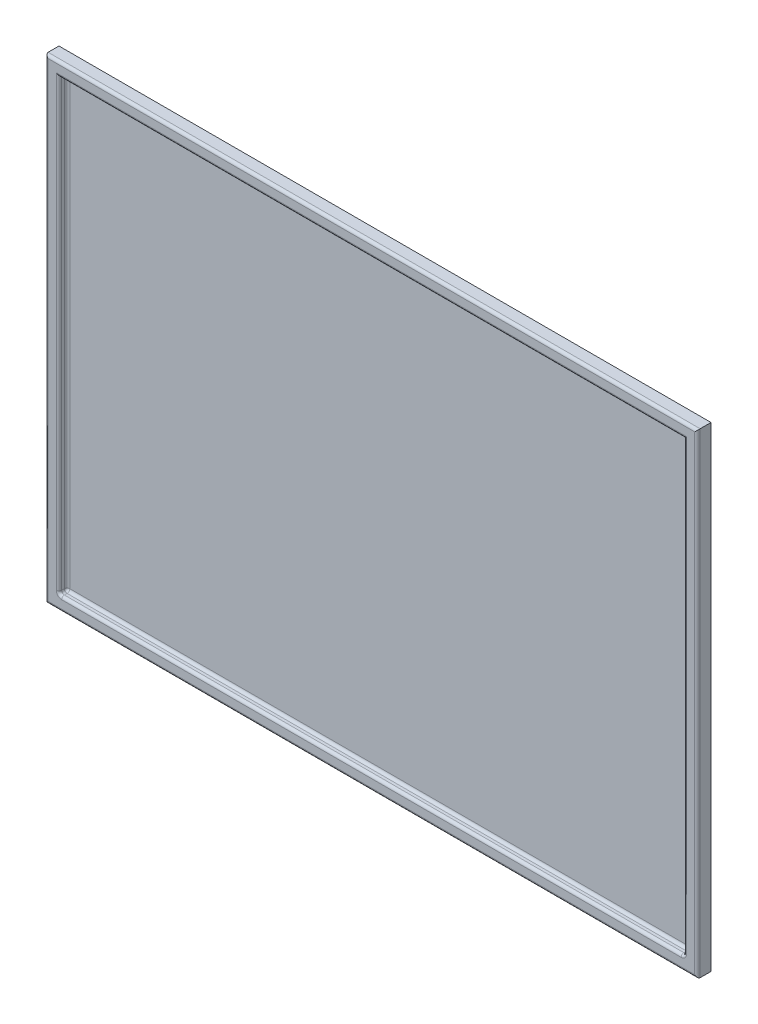
ISO-10303-21;
HEADER;
FILE_DESCRIPTION(('STEP AP214'),'2;1');
FILE_NAME('part.step','',(''),(''),'','','');
FILE_SCHEMA(('AUTOMOTIVE_DESIGN { 1 0 10303 214 1 1 1 1 }'));
ENDSEC;
DATA;
#1=APPLICATION_CONTEXT('core data for automotive mechanical design processes');
#2=APPLICATION_PROTOCOL_DEFINITION('international standard','automotive_design',2000,#1);
#3=PRODUCT_CONTEXT('',#1,'mechanical');
#4=PRODUCT('Part','Part','',(#3));
#5=PRODUCT_RELATED_PRODUCT_CATEGORY('part','',(#4));
#6=PRODUCT_DEFINITION_FORMATION('','',#4);
#7=PRODUCT_DEFINITION_CONTEXT('part definition',#1,'design');
#8=PRODUCT_DEFINITION('design','',#6,#7);
#9=PRODUCT_DEFINITION_SHAPE('','',#8);
#10=(LENGTH_UNIT() NAMED_UNIT(*) SI_UNIT(.MILLI.,.METRE.));
#11=(NAMED_UNIT(*) PLANE_ANGLE_UNIT() SI_UNIT($,.RADIAN.));
#12=(NAMED_UNIT(*) SI_UNIT($,.STERADIAN.) SOLID_ANGLE_UNIT());
#13=UNCERTAINTY_MEASURE_WITH_UNIT(LENGTH_MEASURE(1.E-05),#10,'distance_accuracy_value','');
#14=(GEOMETRIC_REPRESENTATION_CONTEXT(3) GLOBAL_UNCERTAINTY_ASSIGNED_CONTEXT((#13)) GLOBAL_UNIT_ASSIGNED_CONTEXT((#10,
#11,#12)) REPRESENTATION_CONTEXT('',''));
#15=CARTESIAN_POINT('',(0.,0.,0.));
#16=DIRECTION('',(0.,0.,1.));
#17=DIRECTION('',(1.,0.,0.));
#18=AXIS2_PLACEMENT_3D('',#15,#16,#17);
#19=CARTESIAN_POINT('',(-115.182250396197,67.8129952456418,5.));
#20=DIRECTION('',(1.,0.,0.));
#21=DIRECTION('',(0.,1.,0.));
#22=AXIS2_PLACEMENT_3D('',#19,#20,#21);
#23=PLANE('',#22);
#24=DIRECTION('',(0.,0.,-1.));
#25=VECTOR('',#24,1.);
#26=CARTESIAN_POINT('',(-115.182250396196,-107.187004754358,5.));
#27=LINE('',#26,#25);
#28=CARTESIAN_POINT('',(-115.182250396196,-107.187004754358,4.));
#29=VERTEX_POINT('',#28);
#30=CARTESIAN_POINT('',(-115.182250396196,-107.187004754358,0.));
#31=VERTEX_POINT('',#30);
#32=EDGE_CURVE('E161',#29,#31,#27,.T.);
#33=ORIENTED_EDGE('',*,*,#32,.F.);
#34=DIRECTION('',(0.,-1.,0.));
#35=VECTOR('',#34,1.);
#36=CARTESIAN_POINT('',(-115.182250396197,67.8129952456418,4.));
#37=LINE('',#36,#35);
#38=CARTESIAN_POINT('',(-115.182250396197,67.8129952456418,4.));
#39=VERTEX_POINT('',#38);
#40=EDGE_CURVE('E275',#29,#39,#37,.F.);
#41=ORIENTED_EDGE('',*,*,#40,.T.);
#42=DIRECTION('',(0.,0.,-1.));
#43=VECTOR('',#42,1.);
#44=CARTESIAN_POINT('',(-115.182250396197,67.8129952456418,5.));
#45=LINE('',#44,#43);
#46=CARTESIAN_POINT('',(-115.182250396197,67.8129952456418,0.));
#47=VERTEX_POINT('',#46);
#48=EDGE_CURVE('E183',#39,#47,#45,.T.);
#49=ORIENTED_EDGE('',*,*,#48,.T.);
#50=DIRECTION('',(0.,-1.,0.));
#51=VECTOR('',#50,1.);
#52=CARTESIAN_POINT('',(-115.182250396197,67.8129952456418,0.));
#53=LINE('',#52,#51);
#54=EDGE_CURVE('E178',#47,#31,#53,.T.);
#55=ORIENTED_EDGE('',*,*,#54,.T.);
#56=EDGE_LOOP('',(#33,#41,#49,#55));
#57=FACE_BOUND('',#56,.T.);
#58=ADVANCED_FACE('F41',(#57),#23,.F.);
#59=CARTESIAN_POINT('',(-115.182250396196,-107.187004754358,5.));
#60=DIRECTION('',(0.,1.,0.));
#61=DIRECTION('',(-1.,0.,0.));
#62=AXIS2_PLACEMENT_3D('',#59,#60,#61);
#63=PLANE('',#62);
#64=DIRECTION('',(0.,0.,-1.));
#65=VECTOR('',#64,1.);
#66=CARTESIAN_POINT('',(124.817749603803,-107.187004754358,5.));
#67=LINE('',#66,#65);
#68=CARTESIAN_POINT('',(124.817749603803,-107.187004754358,4.));
#69=VERTEX_POINT('',#68);
#70=CARTESIAN_POINT('',(124.817749603803,-107.187004754358,0.));
#71=VERTEX_POINT('',#70);
#72=EDGE_CURVE('E172',#69,#71,#67,.T.);
#73=ORIENTED_EDGE('',*,*,#72,.F.);
#74=DIRECTION('',(1.,0.,0.));
#75=VECTOR('',#74,1.);
#76=CARTESIAN_POINT('',(-115.182250396196,-107.187004754358,4.));
#77=LINE('',#76,#75);
#78=EDGE_CURVE('E168',#69,#29,#77,.F.);
#79=ORIENTED_EDGE('',*,*,#78,.T.);
#80=ORIENTED_EDGE('',*,*,#32,.T.);
#81=DIRECTION('',(1.,0.,0.));
#82=VECTOR('',#81,1.);
#83=CARTESIAN_POINT('',(-115.182250396196,-107.187004754358,0.));
#84=LINE('',#83,#82);
#85=EDGE_CURVE('E165',#31,#71,#84,.T.);
#86=ORIENTED_EDGE('',*,*,#85,.T.);
#87=EDGE_LOOP('',(#73,#79,#80,#86));
#88=FACE_BOUND('',#87,.T.);
#89=ADVANCED_FACE('F164',(#88),#63,.F.);
#90=CARTESIAN_POINT('',(124.817749603803,67.8129952456418,5.));
#91=DIRECTION('',(-1.,0.,0.));
#92=DIRECTION('',(0.,0.,1.));
#93=AXIS2_PLACEMENT_3D('',#90,#91,#92);
#94=PLANE('',#93);
#95=DIRECTION('',(0.,0.,-1.));
#96=VECTOR('',#95,1.);
#97=CARTESIAN_POINT('',(124.817749603803,67.8129952456418,5.));
#98=LINE('',#97,#96);
#99=CARTESIAN_POINT('',(124.817749603803,67.8129952456418,4.));
#100=VERTEX_POINT('',#99);
#101=CARTESIAN_POINT('',(124.817749603803,67.8129952456418,0.));
#102=VERTEX_POINT('',#101);
#103=EDGE_CURVE('E195',#100,#102,#98,.T.);
#104=ORIENTED_EDGE('',*,*,#103,.F.);
#105=DIRECTION('',(0.,1.,0.));
#106=VECTOR('',#105,1.);
#107=CARTESIAN_POINT('',(124.817749603803,-107.187004754358,4.));
#108=LINE('',#107,#106);
#109=EDGE_CURVE('E271',#100,#69,#108,.F.);
#110=ORIENTED_EDGE('',*,*,#109,.T.);
#111=ORIENTED_EDGE('',*,*,#72,.T.);
#112=DIRECTION('',(0.,1.,0.));
#113=VECTOR('',#112,1.);
#114=CARTESIAN_POINT('',(124.817749603803,67.8129952456418,0.));
#115=LINE('',#114,#113);
#116=EDGE_CURVE('E180',#71,#102,#115,.T.);
#117=ORIENTED_EDGE('',*,*,#116,.T.);
#118=EDGE_LOOP('',(#104,#110,#111,#117));
#119=FACE_BOUND('',#118,.T.);
#120=ADVANCED_FACE('F373',(#119),#94,.F.);
#121=CARTESIAN_POINT('',(-115.182250396197,67.8129952456418,5.));
#122=DIRECTION('',(0.,-1.,0.));
#123=DIRECTION('',(0.,0.,-1.));
#124=AXIS2_PLACEMENT_3D('',#121,#122,#123);
#125=PLANE('',#124);
#126=ORIENTED_EDGE('',*,*,#48,.F.);
#127=DIRECTION('',(-1.,0.,0.));
#128=VECTOR('',#127,1.);
#129=CARTESIAN_POINT('',(124.817749603803,67.8129952456418,4.));
#130=LINE('',#129,#128);
#131=EDGE_CURVE('E273',#39,#100,#130,.F.);
#132=ORIENTED_EDGE('',*,*,#131,.T.);
#133=ORIENTED_EDGE('',*,*,#103,.T.);
#134=DIRECTION('',(-1.,0.,0.));
#135=VECTOR('',#134,1.);
#136=CARTESIAN_POINT('',(-115.182250396197,67.8129952456418,0.));
#137=LINE('',#136,#135);
#138=EDGE_CURVE('E192',#102,#47,#137,.T.);
#139=ORIENTED_EDGE('',*,*,#138,.T.);
#140=EDGE_LOOP('',(#126,#132,#133,#139));
#141=FACE_BOUND('',#140,.T.);
#142=ADVANCED_FACE('F547',(#141),#125,.F.);
#143=CARTESIAN_POINT('',(0.,0.,5.));
#144=DIRECTION('',(0.,0.,1.));
#145=DIRECTION('',(1.,0.,0.));
#146=AXIS2_PLACEMENT_3D('',#143,#144,#145);
#147=PLANE('',#146);
#148=DIRECTION('',(0.,-1.,0.));
#149=VECTOR('',#148,1.);
#150=CARTESIAN_POINT('',(-114.182250396196,-107.187004754358,5.));
#151=LINE('',#150,#149);
#152=CARTESIAN_POINT('',(-114.182250396197,66.8129952456418,5.));
#153=VERTEX_POINT('',#152);
#154=CARTESIAN_POINT('',(-114.182250396196,-106.187004754358,5.));
#155=VERTEX_POINT('',#154);
#156=EDGE_CURVE('E237',#153,#155,#151,.T.);
#157=ORIENTED_EDGE('',*,*,#156,.T.);
#158=DIRECTION('',(1.,0.,0.));
#159=VECTOR('',#158,1.);
#160=CARTESIAN_POINT('',(124.817749603803,-106.187004754358,5.));
#161=LINE('',#160,#159);
#162=CARTESIAN_POINT('',(123.817749603803,-106.187004754358,5.));
#163=VERTEX_POINT('',#162);
#164=EDGE_CURVE('E267',#155,#163,#161,.T.);
#165=ORIENTED_EDGE('',*,*,#164,.T.);
#166=DIRECTION('',(0.,1.,0.));
#167=VECTOR('',#166,1.);
#168=CARTESIAN_POINT('',(123.817749603803,67.8129952456418,5.));
#169=LINE('',#168,#167);
#170=CARTESIAN_POINT('',(123.817749603803,66.8129952456418,5.));
#171=VERTEX_POINT('',#170);
#172=EDGE_CURVE('E265',#163,#171,#169,.T.);
#173=ORIENTED_EDGE('',*,*,#172,.T.);
#174=DIRECTION('',(-1.,0.,0.));
#175=VECTOR('',#174,1.);
#176=CARTESIAN_POINT('',(-115.182250396197,66.8129952456418,5.));
#177=LINE('',#176,#175);
#178=EDGE_CURVE('E263',#171,#153,#177,.T.);
#179=ORIENTED_EDGE('',*,*,#178,.T.);
#180=EDGE_LOOP('',(#157,#165,#173,#179));
#181=FACE_BOUND('',#180,.T.);
#182=CARTESIAN_POINT('',(118.817749603803,-101.187004754358,5.));
#183=DIRECTION('',(0.,0.,1.));
#184=DIRECTION('',(1.,0.,0.));
#185=AXIS2_PLACEMENT_3D('',#182,#183,#184);
#186=CIRCLE('',#185,2.);
#187=CARTESIAN_POINT('',(118.817749603803,-103.187004754358,5.));
#188=VERTEX_POINT('',#187);
#189=CARTESIAN_POINT('',(120.817749603803,-101.187004754358,5.));
#190=VERTEX_POINT('',#189);
#191=EDGE_CURVE('E220',#188,#190,#186,.T.);
#192=ORIENTED_EDGE('',*,*,#191,.F.);
#193=DIRECTION('',(1.,0.,0.));
#194=VECTOR('',#193,1.);
#195=CARTESIAN_POINT('',(-110.182250396196,-103.187004754358,5.));
#196=LINE('',#195,#194);
#197=CARTESIAN_POINT('',(-109.182250396196,-103.187004754358,5.));
#198=VERTEX_POINT('',#197);
#199=EDGE_CURVE('E231',#188,#198,#196,.F.);
#200=ORIENTED_EDGE('',*,*,#199,.T.);
#201=CARTESIAN_POINT('',(-109.182250396196,-101.187004754358,5.));
#202=DIRECTION('',(0.,0.,1.));
#203=DIRECTION('',(1.,0.,0.));
#204=AXIS2_PLACEMENT_3D('',#201,#202,#203);
#205=CIRCLE('',#204,2.);
#206=CARTESIAN_POINT('',(-111.182250396196,-101.187004754358,5.));
#207=VERTEX_POINT('',#206);
#208=EDGE_CURVE('E229',#207,#198,#205,.T.);
#209=ORIENTED_EDGE('',*,*,#208,.F.);
#210=DIRECTION('',(0.,-1.,0.));
#211=VECTOR('',#210,1.);
#212=CARTESIAN_POINT('',(-111.182250396197,62.8129952456418,5.));
#213=LINE('',#212,#211);
#214=CARTESIAN_POINT('',(-111.182250396197,63.8129952456418,5.));
#215=VERTEX_POINT('',#214);
#216=EDGE_CURVE('E227',#207,#215,#213,.F.);
#217=ORIENTED_EDGE('',*,*,#216,.T.);
#218=DIRECTION('',(-1.,0.,0.));
#219=VECTOR('',#218,1.);
#220=CARTESIAN_POINT('',(119.817749603803,63.8129952456418,5.));
#221=LINE('',#220,#219);
#222=CARTESIAN_POINT('',(120.817749603803,63.8129952456418,5.));
#223=VERTEX_POINT('',#222);
#224=EDGE_CURVE('E225',#215,#223,#221,.F.);
#225=ORIENTED_EDGE('',*,*,#224,.T.);
#226=DIRECTION('',(0.,1.,0.));
#227=VECTOR('',#226,1.);
#228=CARTESIAN_POINT('',(120.817749603803,-102.187004754358,5.));
#229=LINE('',#228,#227);
#230=EDGE_CURVE('E223',#223,#190,#229,.F.);
#231=ORIENTED_EDGE('',*,*,#230,.T.);
#232=EDGE_LOOP('',(#192,#200,#209,#217,#225,#231));
#233=FACE_BOUND('',#232,.T.);
#234=ADVANCED_FACE('F542',(#181,#233),#147,.T.);
#235=CARTESIAN_POINT('',(0.,0.,0.));
#236=DIRECTION('',(0.,0.,1.));
#237=DIRECTION('',(1.,0.,0.));
#238=AXIS2_PLACEMENT_3D('',#235,#236,#237);
#239=PLANE('',#238);
#240=ORIENTED_EDGE('',*,*,#54,.F.);
#241=ORIENTED_EDGE('',*,*,#138,.F.);
#242=ORIENTED_EDGE('',*,*,#116,.F.);
#243=ORIENTED_EDGE('',*,*,#85,.F.);
#244=EDGE_LOOP('',(#240,#241,#242,#243));
#245=FACE_BOUND('',#244,.T.);
#246=ADVANCED_FACE('F176',(#245),#239,.F.);
#247=CARTESIAN_POINT('',(119.817749603803,62.8129952456418,2.));
#248=DIRECTION('',(0.,1.,0.));
#249=DIRECTION('',(0.,0.,1.));
#250=AXIS2_PLACEMENT_3D('',#247,#248,#249);
#251=PLANE('',#250);
#252=DIRECTION('',(0.,0.,1.));
#253=VECTOR('',#252,1.);
#254=CARTESIAN_POINT('',(-110.182250396197,62.8129952456418,2.));
#255=LINE('',#254,#253);
#256=CARTESIAN_POINT('',(-110.182250396197,62.8129952456418,3.));
#257=VERTEX_POINT('',#256);
#258=CARTESIAN_POINT('',(-110.182250396197,62.8129952456418,4.));
#259=VERTEX_POINT('',#258);
#260=EDGE_CURVE('E187',#257,#259,#255,.T.);
#261=ORIENTED_EDGE('',*,*,#260,.F.);
#262=DIRECTION('',(-1.,0.,0.));
#263=VECTOR('',#262,1.);
#264=CARTESIAN_POINT('',(119.817749603803,62.8129952456418,3.));
#265=LINE('',#264,#263);
#266=CARTESIAN_POINT('',(119.817749603803,62.8129952456418,3.));
#267=VERTEX_POINT('',#266);
#268=EDGE_CURVE('E50',#257,#267,#265,.F.);
#269=ORIENTED_EDGE('',*,*,#268,.T.);
#270=DIRECTION('',(0.,0.,1.));
#271=VECTOR('',#270,1.);
#272=CARTESIAN_POINT('',(119.817749603803,62.8129952456418,2.));
#273=LINE('',#272,#271);
#274=CARTESIAN_POINT('',(119.817749603803,62.8129952456418,4.));
#275=VERTEX_POINT('',#274);
#276=EDGE_CURVE('E185',#267,#275,#273,.T.);
#277=ORIENTED_EDGE('',*,*,#276,.T.);
#278=DIRECTION('',(-1.,0.,0.));
#279=VECTOR('',#278,1.);
#280=CARTESIAN_POINT('',(-110.182250396197,62.8129952456418,4.));
#281=LINE('',#280,#279);
#282=EDGE_CURVE('E234',#275,#259,#281,.T.);
#283=ORIENTED_EDGE('',*,*,#282,.T.);
#284=EDGE_LOOP('',(#261,#269,#277,#283));
#285=FACE_BOUND('',#284,.T.);
#286=ADVANCED_FACE('F504',(#285),#251,.F.);
#287=CARTESIAN_POINT('',(119.817749603803,-102.187004754358,2.));
#288=DIRECTION('',(1.,0.,0.));
#289=DIRECTION('',(0.,0.,-1.));
#290=AXIS2_PLACEMENT_3D('',#287,#288,#289);
#291=PLANE('',#290);
#292=ORIENTED_EDGE('',*,*,#276,.F.);
#293=DIRECTION('',(0.,1.,0.));
#294=VECTOR('',#293,1.);
#295=CARTESIAN_POINT('',(119.817749603803,-102.187004754358,3.));
#296=LINE('',#295,#294);
#297=CARTESIAN_POINT('',(119.817749603803,-101.187004754358,3.));
#298=VERTEX_POINT('',#297);
#299=EDGE_CURVE('E301',#267,#298,#296,.F.);
#300=ORIENTED_EDGE('',*,*,#299,.T.);
#301=DIRECTION('',(0.,0.,1.));
#302=VECTOR('',#301,1.);
#303=CARTESIAN_POINT('',(119.817749603803,-101.187004754358,5.));
#304=LINE('',#303,#302);
#305=CARTESIAN_POINT('',(119.817749603803,-101.187004754358,4.));
#306=VERTEX_POINT('',#305);
#307=EDGE_CURVE('E218',#298,#306,#304,.T.);
#308=ORIENTED_EDGE('',*,*,#307,.T.);
#309=DIRECTION('',(0.,1.,0.));
#310=VECTOR('',#309,1.);
#311=CARTESIAN_POINT('',(119.817749603803,62.8129952456418,4.));
#312=LINE('',#311,#310);
#313=EDGE_CURVE('E215',#306,#275,#312,.T.);
#314=ORIENTED_EDGE('',*,*,#313,.T.);
#315=EDGE_LOOP('',(#292,#300,#308,#314));
#316=FACE_BOUND('',#315,.T.);
#317=ADVANCED_FACE('F495',(#316),#291,.F.);
#318=CARTESIAN_POINT('',(-110.182250396196,-102.187004754358,2.));
#319=DIRECTION('',(0.,-1.,0.));
#320=DIRECTION('',(1.,0.,0.));
#321=AXIS2_PLACEMENT_3D('',#318,#319,#320);
#322=PLANE('',#321);
#323=DIRECTION('',(1.,0.,0.));
#324=VECTOR('',#323,1.);
#325=CARTESIAN_POINT('',(-110.182250396196,-102.187004754358,3.));
#326=LINE('',#325,#324);
#327=CARTESIAN_POINT('',(118.817749603803,-102.187004754358,3.));
#328=VERTEX_POINT('',#327);
#329=CARTESIAN_POINT('',(-109.182250396196,-102.187004754358,3.));
#330=VERTEX_POINT('',#329);
#331=EDGE_CURVE('E202',#328,#330,#326,.F.);
#332=ORIENTED_EDGE('',*,*,#331,.T.);
#333=DIRECTION('',(0.,0.,1.));
#334=VECTOR('',#333,1.);
#335=CARTESIAN_POINT('',(-109.182250396196,-102.187004754358,5.));
#336=LINE('',#335,#334);
#337=CARTESIAN_POINT('',(-109.182250396196,-102.187004754358,4.));
#338=VERTEX_POINT('',#337);
#339=EDGE_CURVE('E205',#330,#338,#336,.T.);
#340=ORIENTED_EDGE('',*,*,#339,.T.);
#341=DIRECTION('',(1.,0.,0.));
#342=VECTOR('',#341,1.);
#343=CARTESIAN_POINT('',(119.817749603803,-102.187004754358,4.));
#344=LINE('',#343,#342);
#345=CARTESIAN_POINT('',(118.817749603803,-102.187004754358,4.));
#346=VERTEX_POINT('',#345);
#347=EDGE_CURVE('E171',#338,#346,#344,.T.);
#348=ORIENTED_EDGE('',*,*,#347,.T.);
#349=DIRECTION('',(0.,0.,1.));
#350=VECTOR('',#349,1.);
#351=CARTESIAN_POINT('',(118.817749603803,-102.187004754358,2.));
#352=LINE('',#351,#350);
#353=EDGE_CURVE('E199',#346,#328,#352,.F.);
#354=ORIENTED_EDGE('',*,*,#353,.T.);
#355=EDGE_LOOP('',(#332,#340,#348,#354));
#356=FACE_BOUND('',#355,.T.);
#357=ADVANCED_FACE('F328',(#356),#322,.F.);
#358=CARTESIAN_POINT('',(-110.182250396197,62.8129952456418,2.));
#359=DIRECTION('',(-1.,0.,0.));
#360=DIRECTION('',(0.,-1.,0.));
#361=AXIS2_PLACEMENT_3D('',#358,#359,#360);
#362=PLANE('',#361);
#363=DIRECTION('',(0.,0.,1.));
#364=VECTOR('',#363,1.);
#365=CARTESIAN_POINT('',(-110.182250396196,-101.187004754358,2.));
#366=LINE('',#365,#364);
#367=CARTESIAN_POINT('',(-110.182250396196,-101.187004754358,4.));
#368=VERTEX_POINT('',#367);
#369=CARTESIAN_POINT('',(-110.182250396196,-101.187004754358,3.));
#370=VERTEX_POINT('',#369);
#371=EDGE_CURVE('E210',#368,#370,#366,.F.);
#372=ORIENTED_EDGE('',*,*,#371,.T.);
#373=DIRECTION('',(0.,-1.,0.));
#374=VECTOR('',#373,1.);
#375=CARTESIAN_POINT('',(-110.182250396197,62.8129952456418,3.));
#376=LINE('',#375,#374);
#377=EDGE_CURVE('E11',#370,#257,#376,.F.);
#378=ORIENTED_EDGE('',*,*,#377,.T.);
#379=ORIENTED_EDGE('',*,*,#260,.T.);
#380=DIRECTION('',(0.,-1.,0.));
#381=VECTOR('',#380,1.);
#382=CARTESIAN_POINT('',(-110.182250396196,-102.187004754358,4.));
#383=LINE('',#382,#381);
#384=EDGE_CURVE('E208',#259,#368,#383,.T.);
#385=ORIENTED_EDGE('',*,*,#384,.T.);
#386=EDGE_LOOP('',(#372,#378,#379,#385));
#387=FACE_BOUND('',#386,.T.);
#388=ADVANCED_FACE('F476',(#387),#362,.F.);
#389=CARTESIAN_POINT('',(0.,0.,2.));
#390=DIRECTION('',(0.,0.,1.));
#391=DIRECTION('',(1.,0.,0.));
#392=AXIS2_PLACEMENT_3D('',#389,#390,#391);
#393=PLANE('',#392);
#394=DIRECTION('',(1.,0.,0.));
#395=VECTOR('',#394,1.);
#396=CARTESIAN_POINT('',(0.,-101.187004754358,2.));
#397=LINE('',#396,#395);
#398=CARTESIAN_POINT('',(-109.182250396196,-101.187004754358,2.));
#399=VERTEX_POINT('',#398);
#400=CARTESIAN_POINT('',(118.817749603803,-101.187004754358,2.));
#401=VERTEX_POINT('',#400);
#402=EDGE_CURVE('E212',#399,#401,#397,.T.);
#403=ORIENTED_EDGE('',*,*,#402,.T.);
#404=DIRECTION('',(0.,1.,0.));
#405=VECTOR('',#404,1.);
#406=CARTESIAN_POINT('',(118.817749603803,0.,2.));
#407=LINE('',#406,#405);
#408=CARTESIAN_POINT('',(118.817749603803,61.8129952456418,2.));
#409=VERTEX_POINT('',#408);
#410=EDGE_CURVE('E299',#401,#409,#407,.T.);
#411=ORIENTED_EDGE('',*,*,#410,.T.);
#412=DIRECTION('',(-1.,0.,0.));
#413=VECTOR('',#412,1.);
#414=CARTESIAN_POINT('',(0.,61.8129952456418,2.));
#415=LINE('',#414,#413);
#416=CARTESIAN_POINT('',(-109.182250396196,61.8129952456418,2.));
#417=VERTEX_POINT('',#416);
#418=EDGE_CURVE('E297',#409,#417,#415,.T.);
#419=ORIENTED_EDGE('',*,*,#418,.T.);
#420=DIRECTION('',(0.,-1.,0.));
#421=VECTOR('',#420,1.);
#422=CARTESIAN_POINT('',(-109.182250396196,0.,2.));
#423=LINE('',#422,#421);
#424=EDGE_CURVE('E295',#417,#399,#423,.T.);
#425=ORIENTED_EDGE('',*,*,#424,.T.);
#426=EDGE_LOOP('',(#403,#411,#419,#425));
#427=FACE_BOUND('',#426,.T.);
#428=ADVANCED_FACE('F359',(#427),#393,.T.);
#429=CARTESIAN_POINT('',(120.817749603803,-102.187004754358,4.));
#430=DIRECTION('',(0.,-1.,0.));
#431=DIRECTION('',(0.,0.,-1.));
#432=AXIS2_PLACEMENT_3D('',#429,#430,#431);
#433=CYLINDRICAL_SURFACE('',#432,1.);
#434=CARTESIAN_POINT('',(120.817749603803,-101.187004754358,4.));
#435=DIRECTION('',(0.,-1.,0.));
#436=DIRECTION('',(0.,0.,-1.));
#437=AXIS2_PLACEMENT_3D('',#434,#435,#436);
#438=CIRCLE('',#437,1.);
#439=EDGE_CURVE('E259',#190,#306,#438,.T.);
#440=ORIENTED_EDGE('',*,*,#439,.F.);
#441=ORIENTED_EDGE('',*,*,#230,.F.);
#442=CARTESIAN_POINT('',(120.817749603803,63.8129952456418,4.));
#443=DIRECTION('',(0.707106781186547,-0.707106781186547,0.));
#444=DIRECTION('',(0.707106781186547,0.707106781186547,0.));
#445=AXIS2_PLACEMENT_3D('',#442,#443,#444);
#446=ELLIPSE('',#445,1.41421356237309,1.);
#447=EDGE_CURVE('E256',#275,#223,#446,.F.);
#448=ORIENTED_EDGE('',*,*,#447,.F.);
#449=ORIENTED_EDGE('',*,*,#313,.F.);
#450=EDGE_LOOP('',(#440,#441,#448,#449));
#451=FACE_BOUND('',#450,.T.);
#452=ADVANCED_FACE('F398',(#451),#433,.T.);
#453=CARTESIAN_POINT('',(118.817749603803,-101.187004754358,4.));
#454=DIRECTION('',(0.,0.,1.));
#455=DIRECTION('',(1.,0.,0.));
#456=AXIS2_PLACEMENT_3D('',#453,#454,#455);
#457=TOROIDAL_SURFACE('',#456,2.,1.);
#458=ORIENTED_EDGE('',*,*,#191,.T.);
#459=ORIENTED_EDGE('',*,*,#439,.T.);
#460=CARTESIAN_POINT('',(118.817749603803,-101.187004754358,4.));
#461=DIRECTION('',(0.,0.,1.));
#462=DIRECTION('',(1.,0.,0.));
#463=AXIS2_PLACEMENT_3D('',#460,#461,#462);
#464=CIRCLE('',#463,1.);
#465=EDGE_CURVE('E253',#346,#306,#464,.T.);
#466=ORIENTED_EDGE('',*,*,#465,.F.);
#467=CARTESIAN_POINT('',(118.817749603803,-103.187004754358,4.));
#468=DIRECTION('',(1.,0.,0.));
#469=DIRECTION('',(0.,0.,-1.));
#470=AXIS2_PLACEMENT_3D('',#467,#468,#469);
#471=CIRCLE('',#470,1.);
#472=EDGE_CURVE('E250',#188,#346,#471,.F.);
#473=ORIENTED_EDGE('',*,*,#472,.F.);
#474=EDGE_LOOP('',(#458,#459,#466,#473));
#475=FACE_BOUND('',#474,.T.);
#476=ADVANCED_FACE('F344',(#475),#457,.T.);
#477=CARTESIAN_POINT('',(119.817749603803,63.8129952456418,4.));
#478=DIRECTION('',(1.,0.,0.));
#479=DIRECTION('',(0.,0.,-1.));
#480=AXIS2_PLACEMENT_3D('',#477,#478,#479);
#481=CYLINDRICAL_SURFACE('',#480,1.);
#482=ORIENTED_EDGE('',*,*,#447,.T.);
#483=ORIENTED_EDGE('',*,*,#224,.F.);
#484=CARTESIAN_POINT('',(-111.182250396197,63.8129952456418,4.));
#485=DIRECTION('',(0.707106781186547,0.707106781186548,0.));
#486=DIRECTION('',(-0.707106781186548,0.707106781186547,0.));
#487=AXIS2_PLACEMENT_3D('',#484,#485,#486);
#488=ELLIPSE('',#487,1.4142135623731,1.);
#489=EDGE_CURVE('E247',#259,#215,#488,.F.);
#490=ORIENTED_EDGE('',*,*,#489,.F.);
#491=ORIENTED_EDGE('',*,*,#282,.F.);
#492=EDGE_LOOP('',(#482,#483,#490,#491));
#493=FACE_BOUND('',#492,.T.);
#494=ADVANCED_FACE('F392',(#493),#481,.T.);
#495=CARTESIAN_POINT('',(118.817749603803,-101.187004754358,2.));
#496=DIRECTION('',(0.,0.,-1.));
#497=DIRECTION('',(-1.,0.,0.));
#498=AXIS2_PLACEMENT_3D('',#495,#496,#497);
#499=CYLINDRICAL_SURFACE('',#498,1.);
#500=ORIENTED_EDGE('',*,*,#307,.F.);
#501=CARTESIAN_POINT('',(118.817749603803,-101.187004754358,3.));
#502=DIRECTION('',(0.,0.,-1.));
#503=DIRECTION('',(-1.,0.,0.));
#504=AXIS2_PLACEMENT_3D('',#501,#502,#503);
#505=CIRCLE('',#504,1.);
#506=EDGE_CURVE('E291',#298,#328,#505,.T.);
#507=ORIENTED_EDGE('',*,*,#506,.T.);
#508=ORIENTED_EDGE('',*,*,#353,.F.);
#509=ORIENTED_EDGE('',*,*,#465,.T.);
#510=EDGE_LOOP('',(#500,#507,#508,#509));
#511=FACE_BOUND('',#510,.T.);
#512=ADVANCED_FACE('F348',(#511),#499,.F.);
#513=CARTESIAN_POINT('',(-110.182250396196,-103.187004754358,4.));
#514=DIRECTION('',(-1.,0.,0.));
#515=DIRECTION('',(0.,-1.,0.));
#516=AXIS2_PLACEMENT_3D('',#513,#514,#515);
#517=CYLINDRICAL_SURFACE('',#516,1.);
#518=ORIENTED_EDGE('',*,*,#472,.T.);
#519=ORIENTED_EDGE('',*,*,#347,.F.);
#520=CARTESIAN_POINT('',(-109.182250396196,-103.187004754358,4.));
#521=DIRECTION('',(-1.,0.,0.));
#522=DIRECTION('',(0.,0.,1.));
#523=AXIS2_PLACEMENT_3D('',#520,#521,#522);
#524=CIRCLE('',#523,1.);
#525=EDGE_CURVE('E244',#198,#338,#524,.T.);
#526=ORIENTED_EDGE('',*,*,#525,.F.);
#527=ORIENTED_EDGE('',*,*,#199,.F.);
#528=EDGE_LOOP('',(#518,#519,#526,#527));
#529=FACE_BOUND('',#528,.T.);
#530=ADVANCED_FACE('F340',(#529),#517,.T.);
#531=CARTESIAN_POINT('',(-111.182250396197,62.8129952456418,4.));
#532=DIRECTION('',(0.,1.,0.));
#533=DIRECTION('',(-1.,0.,0.));
#534=AXIS2_PLACEMENT_3D('',#531,#532,#533);
#535=CYLINDRICAL_SURFACE('',#534,1.);
#536=ORIENTED_EDGE('',*,*,#489,.T.);
#537=ORIENTED_EDGE('',*,*,#216,.F.);
#538=CARTESIAN_POINT('',(-111.182250396196,-101.187004754358,4.));
#539=DIRECTION('',(0.,-1.,0.));
#540=DIRECTION('',(0.,0.,-1.));
#541=AXIS2_PLACEMENT_3D('',#538,#539,#540);
#542=CIRCLE('',#541,1.);
#543=EDGE_CURVE('E240',#368,#207,#542,.T.);
#544=ORIENTED_EDGE('',*,*,#543,.F.);
#545=ORIENTED_EDGE('',*,*,#384,.F.);
#546=EDGE_LOOP('',(#536,#537,#544,#545));
#547=FACE_BOUND('',#546,.T.);
#548=ADVANCED_FACE('F384',(#547),#535,.T.);
#549=CARTESIAN_POINT('',(0.,-101.187004754358,3.));
#550=DIRECTION('',(1.,0.,0.));
#551=DIRECTION('',(0.,1.,0.));
#552=AXIS2_PLACEMENT_3D('',#549,#550,#551);
#553=CYLINDRICAL_SURFACE('',#552,1.);
#554=ORIENTED_EDGE('',*,*,#331,.F.);
#555=CARTESIAN_POINT('',(118.817749603803,-101.187004754358,3.));
#556=DIRECTION('',(1.,0.,0.));
#557=DIRECTION('',(0.,1.,0.));
#558=AXIS2_PLACEMENT_3D('',#555,#556,#557);
#559=CIRCLE('',#558,1.);
#560=EDGE_CURVE('E288',#328,#401,#559,.T.);
#561=ORIENTED_EDGE('',*,*,#560,.T.);
#562=ORIENTED_EDGE('',*,*,#402,.F.);
#563=CARTESIAN_POINT('',(-109.182250396196,-101.187004754358,3.));
#564=DIRECTION('',(1.,0.,0.));
#565=DIRECTION('',(0.,1.,0.));
#566=AXIS2_PLACEMENT_3D('',#563,#564,#565);
#567=CIRCLE('',#566,1.);
#568=EDGE_CURVE('E277',#399,#330,#567,.F.);
#569=ORIENTED_EDGE('',*,*,#568,.T.);
#570=EDGE_LOOP('',(#554,#561,#562,#569));
#571=FACE_BOUND('',#570,.T.);
#572=ADVANCED_FACE('F324',(#571),#553,.F.);
#573=CARTESIAN_POINT('',(-109.182250396196,-101.187004754358,4.));
#574=DIRECTION('',(0.,0.,1.));
#575=DIRECTION('',(1.,0.,0.));
#576=AXIS2_PLACEMENT_3D('',#573,#574,#575);
#577=TOROIDAL_SURFACE('',#576,2.,1.);
#578=ORIENTED_EDGE('',*,*,#208,.T.);
#579=ORIENTED_EDGE('',*,*,#525,.T.);
#580=CARTESIAN_POINT('',(-109.182250396196,-101.187004754358,4.));
#581=DIRECTION('',(0.,0.,1.));
#582=DIRECTION('',(1.,0.,0.));
#583=AXIS2_PLACEMENT_3D('',#580,#581,#582);
#584=CIRCLE('',#583,1.);
#585=EDGE_CURVE('E238',#368,#338,#584,.T.);
#586=ORIENTED_EDGE('',*,*,#585,.F.);
#587=ORIENTED_EDGE('',*,*,#543,.T.);
#588=EDGE_LOOP('',(#578,#579,#586,#587));
#589=FACE_BOUND('',#588,.T.);
#590=ADVANCED_FACE('F337',(#589),#577,.T.);
#591=CARTESIAN_POINT('',(-109.182250396196,-101.187004754358,2.));
#592=DIRECTION('',(0.,0.,-1.));
#593=DIRECTION('',(-1.,0.,0.));
#594=AXIS2_PLACEMENT_3D('',#591,#592,#593);
#595=CYLINDRICAL_SURFACE('',#594,1.);
#596=ORIENTED_EDGE('',*,*,#339,.F.);
#597=CARTESIAN_POINT('',(-109.182250396196,-101.187004754358,3.));
#598=DIRECTION('',(0.,0.,-1.));
#599=DIRECTION('',(-1.,0.,0.));
#600=AXIS2_PLACEMENT_3D('',#597,#598,#599);
#601=CIRCLE('',#600,1.);
#602=EDGE_CURVE('E293',#330,#370,#601,.T.);
#603=ORIENTED_EDGE('',*,*,#602,.T.);
#604=ORIENTED_EDGE('',*,*,#371,.F.);
#605=ORIENTED_EDGE('',*,*,#585,.T.);
#606=EDGE_LOOP('',(#596,#603,#604,#605));
#607=FACE_BOUND('',#606,.T.);
#608=ADVANCED_FACE('F331',(#607),#595,.F.);
#609=CARTESIAN_POINT('',(0.,66.8129952456418,4.));
#610=DIRECTION('',(1.,0.,0.));
#611=DIRECTION('',(0.,0.,-1.));
#612=AXIS2_PLACEMENT_3D('',#609,#610,#611);
#613=CYLINDRICAL_SURFACE('',#612,1.);
#614=CARTESIAN_POINT('',(123.817749603803,66.8129952456418,4.));
#615=DIRECTION('',(0.707106781186547,-0.707106781186547,0.));
#616=DIRECTION('',(0.707106781186547,0.707106781186547,0.));
#617=AXIS2_PLACEMENT_3D('',#614,#615,#616);
#618=ELLIPSE('',#617,1.41421356237309,1.);
#619=EDGE_CURVE('E282',#100,#171,#618,.T.);
#620=ORIENTED_EDGE('',*,*,#619,.F.);
#621=ORIENTED_EDGE('',*,*,#131,.F.);
#622=CARTESIAN_POINT('',(-114.182250396197,66.8129952456418,4.));
#623=DIRECTION('',(0.707106781186547,0.707106781186548,0.));
#624=DIRECTION('',(-0.707106781186548,0.707106781186547,0.));
#625=AXIS2_PLACEMENT_3D('',#622,#623,#624);
#626=ELLIPSE('',#625,1.4142135623731,1.);
#627=EDGE_CURVE('E241',#153,#39,#626,.F.);
#628=ORIENTED_EDGE('',*,*,#627,.F.);
#629=ORIENTED_EDGE('',*,*,#178,.F.);
#630=EDGE_LOOP('',(#620,#621,#628,#629));
#631=FACE_BOUND('',#630,.T.);
#632=ADVANCED_FACE('F379',(#631),#613,.T.);
#633=CARTESIAN_POINT('',(-114.182250396196,0.,4.));
#634=DIRECTION('',(0.,1.,0.));
#635=DIRECTION('',(-1.,0.,0.));
#636=AXIS2_PLACEMENT_3D('',#633,#634,#635);
#637=CYLINDRICAL_SURFACE('',#636,1.);
#638=ORIENTED_EDGE('',*,*,#627,.T.);
#639=ORIENTED_EDGE('',*,*,#40,.F.);
#640=CARTESIAN_POINT('',(-114.182250396196,-106.187004754358,4.));
#641=DIRECTION('',(-0.707106781186548,0.707106781186547,0.));
#642=DIRECTION('',(0.707106781186547,0.707106781186547,0.));
#643=AXIS2_PLACEMENT_3D('',#640,#641,#642);
#644=ELLIPSE('',#643,1.41421356237309,1.);
#645=EDGE_CURVE('E280',#155,#29,#644,.F.);
#646=ORIENTED_EDGE('',*,*,#645,.F.);
#647=ORIENTED_EDGE('',*,*,#156,.F.);
#648=EDGE_LOOP('',(#638,#639,#646,#647));
#649=FACE_BOUND('',#648,.T.);
#650=ADVANCED_FACE('F409',(#649),#637,.T.);
#651=CARTESIAN_POINT('',(123.817749603803,0.,4.));
#652=DIRECTION('',(0.,-1.,0.));
#653=DIRECTION('',(0.,0.,-1.));
#654=AXIS2_PLACEMENT_3D('',#651,#652,#653);
#655=CYLINDRICAL_SURFACE('',#654,1.);
#656=ORIENTED_EDGE('',*,*,#619,.T.);
#657=ORIENTED_EDGE('',*,*,#172,.F.);
#658=CARTESIAN_POINT('',(123.817749603803,-106.187004754358,4.));
#659=DIRECTION('',(-0.707106781186548,-0.707106781186547,0.));
#660=DIRECTION('',(0.707106781186547,-0.707106781186547,0.));
#661=AXIS2_PLACEMENT_3D('',#658,#659,#660);
#662=ELLIPSE('',#661,1.4142135623731,1.);
#663=EDGE_CURVE('E278',#69,#163,#662,.T.);
#664=ORIENTED_EDGE('',*,*,#663,.F.);
#665=ORIENTED_EDGE('',*,*,#109,.F.);
#666=EDGE_LOOP('',(#656,#657,#664,#665));
#667=FACE_BOUND('',#666,.T.);
#668=ADVANCED_FACE('F405',(#667),#655,.T.);
#669=CARTESIAN_POINT('',(0.,-106.187004754358,4.));
#670=DIRECTION('',(-1.,0.,0.));
#671=DIRECTION('',(0.,-1.,0.));
#672=AXIS2_PLACEMENT_3D('',#669,#670,#671);
#673=CYLINDRICAL_SURFACE('',#672,1.);
#674=ORIENTED_EDGE('',*,*,#645,.T.);
#675=ORIENTED_EDGE('',*,*,#78,.F.);
#676=ORIENTED_EDGE('',*,*,#663,.T.);
#677=ORIENTED_EDGE('',*,*,#164,.F.);
#678=EDGE_LOOP('',(#674,#675,#676,#677));
#679=FACE_BOUND('',#678,.T.);
#680=ADVANCED_FACE('F402',(#679),#673,.T.);
#681=CARTESIAN_POINT('',(-109.182250396196,-101.187004754358,3.));
#682=DIRECTION('',(0.,0.,1.));
#683=DIRECTION('',(1.,0.,0.));
#684=AXIS2_PLACEMENT_3D('',#681,#682,#683);
#685=SPHERICAL_SURFACE('',#684,1.);
#686=ORIENTED_EDGE('',*,*,#602,.F.);
#687=ORIENTED_EDGE('',*,*,#568,.F.);
#688=CARTESIAN_POINT('',(-109.182250396196,-101.187004754358,3.));
#689=DIRECTION('',(0.,-1.,0.));
#690=DIRECTION('',(0.,0.,-1.));
#691=AXIS2_PLACEMENT_3D('',#688,#689,#690);
#692=CIRCLE('',#691,1.);
#693=EDGE_CURVE('E45',#370,#399,#692,.T.);
#694=ORIENTED_EDGE('',*,*,#693,.F.);
#695=EDGE_LOOP('',(#686,#687,#694));
#696=FACE_BOUND('',#695,.T.);
#697=ADVANCED_FACE('F43',(#696),#685,.F.);
#698=CARTESIAN_POINT('',(-109.182250396196,0.,3.));
#699=DIRECTION('',(0.,-1.,0.));
#700=DIRECTION('',(1.,0.,0.));
#701=AXIS2_PLACEMENT_3D('',#698,#699,#700);
#702=CYLINDRICAL_SURFACE('',#701,1.);
#703=ORIENTED_EDGE('',*,*,#693,.T.);
#704=ORIENTED_EDGE('',*,*,#424,.F.);
#705=CARTESIAN_POINT('',(-109.182250396196,61.8129952456418,3.));
#706=DIRECTION('',(-0.707106781186547,-0.707106781186548,0.));
#707=DIRECTION('',(-0.707106781186548,0.707106781186547,0.));
#708=AXIS2_PLACEMENT_3D('',#705,#706,#707);
#709=ELLIPSE('',#708,1.4142135623731,1.);
#710=EDGE_CURVE('E308',#257,#417,#709,.T.);
#711=ORIENTED_EDGE('',*,*,#710,.F.);
#712=ORIENTED_EDGE('',*,*,#377,.F.);
#713=EDGE_LOOP('',(#703,#704,#711,#712));
#714=FACE_BOUND('',#713,.T.);
#715=ADVANCED_FACE('F317',(#714),#702,.F.);
#716=CARTESIAN_POINT('',(0.,61.8129952456418,3.));
#717=DIRECTION('',(-1.,0.,0.));
#718=DIRECTION('',(0.,0.,1.));
#719=AXIS2_PLACEMENT_3D('',#716,#717,#718);
#720=CYLINDRICAL_SURFACE('',#719,1.);
#721=ORIENTED_EDGE('',*,*,#710,.T.);
#722=ORIENTED_EDGE('',*,*,#418,.F.);
#723=CARTESIAN_POINT('',(118.817749603803,61.8129952456418,3.));
#724=DIRECTION('',(-0.707106781186547,0.707106781186547,0.));
#725=DIRECTION('',(0.707106781186547,0.707106781186547,0.));
#726=AXIS2_PLACEMENT_3D('',#723,#724,#725);
#727=ELLIPSE('',#726,1.41421356237309,1.);
#728=EDGE_CURVE('E306',#267,#409,#727,.T.);
#729=ORIENTED_EDGE('',*,*,#728,.F.);
#730=ORIENTED_EDGE('',*,*,#268,.F.);
#731=EDGE_LOOP('',(#721,#722,#729,#730));
#732=FACE_BOUND('',#731,.T.);
#733=ADVANCED_FACE('F360',(#732),#720,.F.);
#734=CARTESIAN_POINT('',(118.817749603803,0.,3.));
#735=DIRECTION('',(0.,1.,0.));
#736=DIRECTION('',(0.,0.,1.));
#737=AXIS2_PLACEMENT_3D('',#734,#735,#736);
#738=CYLINDRICAL_SURFACE('',#737,1.);
#739=ORIENTED_EDGE('',*,*,#728,.T.);
#740=ORIENTED_EDGE('',*,*,#410,.F.);
#741=CARTESIAN_POINT('',(118.817749603803,-101.187004754358,3.));
#742=DIRECTION('',(0.,1.,0.));
#743=DIRECTION('',(0.,0.,1.));
#744=AXIS2_PLACEMENT_3D('',#741,#742,#743);
#745=CIRCLE('',#744,1.);
#746=EDGE_CURVE('E304',#298,#401,#745,.T.);
#747=ORIENTED_EDGE('',*,*,#746,.F.);
#748=ORIENTED_EDGE('',*,*,#299,.F.);
#749=EDGE_LOOP('',(#739,#740,#747,#748));
#750=FACE_BOUND('',#749,.T.);
#751=ADVANCED_FACE('F356',(#750),#738,.F.);
#752=CARTESIAN_POINT('',(118.817749603803,-101.187004754358,3.));
#753=DIRECTION('',(0.,0.,1.));
#754=DIRECTION('',(1.,0.,0.));
#755=AXIS2_PLACEMENT_3D('',#752,#753,#754);
#756=SPHERICAL_SURFACE('',#755,1.);
#757=ORIENTED_EDGE('',*,*,#560,.F.);
#758=ORIENTED_EDGE('',*,*,#506,.F.);
#759=ORIENTED_EDGE('',*,*,#746,.T.);
#760=EDGE_LOOP('',(#757,#758,#759));
#761=FACE_BOUND('',#760,.T.);
#762=ADVANCED_FACE('F352',(#761),#756,.F.);
#763=CLOSED_SHELL('',(#58,#89,#120,#142,#234,#246,#286,#317,#357,#388,#428,#452,#476,#494,#512,
#530,#548,#572,#590,#608,#632,#650,#668,#680,#697,#715,#733,#751,#762));
#764=MANIFOLD_SOLID_BREP('B2',#763);
#765=ADVANCED_BREP_SHAPE_REPRESENTATION('',(#18,#764),#14);
#766=SHAPE_DEFINITION_REPRESENTATION(#9,#765);
ENDSEC;
END-ISO-10303-21;
